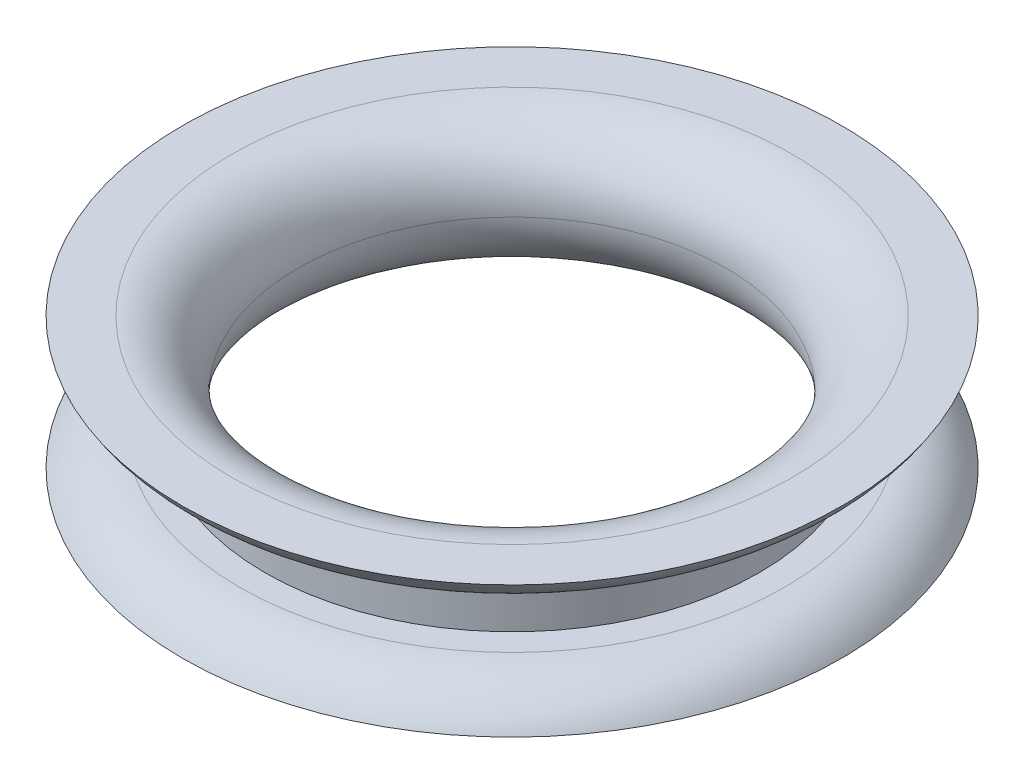
ISO-10303-21;
HEADER;
FILE_DESCRIPTION(('STEP AP214'),'2;1');
FILE_NAME('part.step','',(''),(''),'','','');
FILE_SCHEMA(('AUTOMOTIVE_DESIGN { 1 0 10303 214 1 1 1 1 }'));
ENDSEC;
DATA;
#1=APPLICATION_CONTEXT('core data for automotive mechanical design processes');
#2=APPLICATION_PROTOCOL_DEFINITION('international standard','automotive_design',2000,#1);
#3=PRODUCT_CONTEXT('',#1,'mechanical');
#4=PRODUCT('Part','Part','',(#3));
#5=PRODUCT_RELATED_PRODUCT_CATEGORY('part','',(#4));
#6=PRODUCT_DEFINITION_FORMATION('','',#4);
#7=PRODUCT_DEFINITION_CONTEXT('part definition',#1,'design');
#8=PRODUCT_DEFINITION('design','',#6,#7);
#9=PRODUCT_DEFINITION_SHAPE('','',#8);
#10=(LENGTH_UNIT() NAMED_UNIT(*) SI_UNIT(.MILLI.,.METRE.));
#11=(NAMED_UNIT(*) PLANE_ANGLE_UNIT() SI_UNIT($,.RADIAN.));
#12=(NAMED_UNIT(*) SI_UNIT($,.STERADIAN.) SOLID_ANGLE_UNIT());
#13=UNCERTAINTY_MEASURE_WITH_UNIT(LENGTH_MEASURE(1.E-05),#10,'distance_accuracy_value','');
#14=(GEOMETRIC_REPRESENTATION_CONTEXT(3) GLOBAL_UNCERTAINTY_ASSIGNED_CONTEXT((#13)) GLOBAL_UNIT_ASSIGNED_CONTEXT((#10,
#11,#12)) REPRESENTATION_CONTEXT('',''));
#15=CARTESIAN_POINT('',(0.,0.,0.));
#16=DIRECTION('',(0.,0.,1.));
#17=DIRECTION('',(1.,0.,0.));
#18=AXIS2_PLACEMENT_3D('',#15,#16,#17);
#19=CARTESIAN_POINT('',(0.,1.27,0.));
#20=DIRECTION('',(0.,1.,0.));
#21=DIRECTION('',(0.,0.,1.));
#22=AXIS2_PLACEMENT_3D('',#19,#20,#21);
#23=PLANE('',#22);
#24=CARTESIAN_POINT('',(0.,1.27,0.));
#25=DIRECTION('',(0.,1.,0.));
#26=DIRECTION('',(0.,0.,1.));
#27=AXIS2_PLACEMENT_3D('',#24,#25,#26);
#28=CIRCLE('',#27,10.5002954743875);
#29=CARTESIAN_POINT('',(0.,1.27,10.5002954743875));
#30=VERTEX_POINT('',#29);
#31=EDGE_CURVE('E57',#30,#30,#28,.T.);
#32=ORIENTED_EDGE('',*,*,#31,.T.);
#33=EDGE_LOOP('',(#32));
#34=FACE_BOUND('',#33,.T.);
#35=CARTESIAN_POINT('',(0.,1.27,0.));
#36=DIRECTION('',(0.,1.,0.));
#37=DIRECTION('',(0.,0.,1.));
#38=AXIS2_PLACEMENT_3D('',#35,#36,#37);
#39=CIRCLE('',#38,9.525);
#40=CARTESIAN_POINT('',(0.,1.27,9.525));
#41=VERTEX_POINT('',#40);
#42=EDGE_CURVE('E61',#41,#41,#39,.T.);
#43=ORIENTED_EDGE('',*,*,#42,.F.);
#44=EDGE_LOOP('',(#43));
#45=FACE_BOUND('',#44,.T.);
#46=ADVANCED_FACE('F37',(#34,#45),#23,.T.);
#47=CARTESIAN_POINT('',(0.,0.,0.));
#48=DIRECTION('',(0.,1.,0.));
#49=DIRECTION('',(0.,0.,1.));
#50=AXIS2_PLACEMENT_3D('',#47,#48,#49);
#51=PLANE('',#50);
#52=CARTESIAN_POINT('',(0.,0.,0.));
#53=DIRECTION('',(0.,1.,0.));
#54=DIRECTION('',(0.,0.,1.));
#55=AXIS2_PLACEMENT_3D('',#52,#53,#54);
#56=CIRCLE('',#55,10.795);
#57=CARTESIAN_POINT('',(0.,0.,10.795));
#58=VERTEX_POINT('',#57);
#59=EDGE_CURVE('E46',#58,#58,#56,.T.);
#60=ORIENTED_EDGE('',*,*,#59,.T.);
#61=EDGE_LOOP('',(#60));
#62=FACE_BOUND('',#61,.T.);
#63=CARTESIAN_POINT('',(0.,0.,0.));
#64=DIRECTION('',(0.,1.,0.));
#65=DIRECTION('',(0.,0.,1.));
#66=AXIS2_PLACEMENT_3D('',#63,#64,#65);
#67=CIRCLE('',#66,12.7);
#68=CARTESIAN_POINT('',(0.,0.,12.7));
#69=VERTEX_POINT('',#68);
#70=EDGE_CURVE('E62',#69,#69,#67,.T.);
#71=ORIENTED_EDGE('',*,*,#70,.F.);
#72=EDGE_LOOP('',(#71));
#73=FACE_BOUND('',#72,.T.);
#74=ADVANCED_FACE('F96',(#62,#73),#51,.F.);
#75=CARTESIAN_POINT('',(0.,3.81,0.));
#76=DIRECTION('',(0.,-1.,0.));
#77=DIRECTION('',(0.,0.,-1.));
#78=AXIS2_PLACEMENT_3D('',#75,#76,#77);
#79=CYLINDRICAL_SURFACE('',#78,9.525);
#80=CARTESIAN_POINT('',(0.,3.81,0.));
#81=DIRECTION('',(0.,1.,0.));
#82=DIRECTION('',(0.,0.,1.));
#83=AXIS2_PLACEMENT_3D('',#80,#81,#82);
#84=CIRCLE('',#83,9.525);
#85=CARTESIAN_POINT('',(0.,3.81,9.525));
#86=VERTEX_POINT('',#85);
#87=EDGE_CURVE('E66',#86,#86,#84,.T.);
#88=ORIENTED_EDGE('',*,*,#87,.F.);
#89=EDGE_LOOP('',(#88));
#90=FACE_BOUND('',#89,.T.);
#91=ORIENTED_EDGE('',*,*,#42,.T.);
#92=EDGE_LOOP('',(#91));
#93=FACE_BOUND('',#92,.T.);
#94=ADVANCED_FACE('F102',(#90,#93),#79,.T.);
#95=CARTESIAN_POINT('',(0.,5.08,0.));
#96=DIRECTION('',(0.,1.,0.));
#97=DIRECTION('',(0.,0.,1.));
#98=AXIS2_PLACEMENT_3D('',#95,#96,#97);
#99=PLANE('',#98);
#100=CARTESIAN_POINT('',(0.,5.08,0.));
#101=DIRECTION('',(0.,1.,0.));
#102=DIRECTION('',(0.,0.,1.));
#103=AXIS2_PLACEMENT_3D('',#100,#101,#102);
#104=CIRCLE('',#103,10.795);
#105=CARTESIAN_POINT('',(0.,5.08,10.795));
#106=VERTEX_POINT('',#105);
#107=EDGE_CURVE('E10',#106,#106,#104,.F.);
#108=ORIENTED_EDGE('',*,*,#107,.T.);
#109=EDGE_LOOP('',(#108));
#110=FACE_BOUND('',#109,.T.);
#111=CARTESIAN_POINT('',(0.,5.08,0.));
#112=DIRECTION('',(0.,1.,0.));
#113=DIRECTION('',(0.,0.,1.));
#114=AXIS2_PLACEMENT_3D('',#111,#112,#113);
#115=CIRCLE('',#114,12.7);
#116=CARTESIAN_POINT('',(0.,5.08,12.7));
#117=VERTEX_POINT('',#116);
#118=EDGE_CURVE('E73',#117,#117,#115,.T.);
#119=ORIENTED_EDGE('',*,*,#118,.T.);
#120=EDGE_LOOP('',(#119));
#121=FACE_BOUND('',#120,.T.);
#122=ADVANCED_FACE('F115',(#110,#121),#99,.T.);
#123=CARTESIAN_POINT('',(0.,3.81,0.));
#124=DIRECTION('',(0.,1.,0.));
#125=DIRECTION('',(0.,0.,1.));
#126=AXIS2_PLACEMENT_3D('',#123,#124,#125);
#127=PLANE('',#126);
#128=CARTESIAN_POINT('',(0.,3.81,0.));
#129=DIRECTION('',(0.,1.,0.));
#130=DIRECTION('',(0.,0.,1.));
#131=AXIS2_PLACEMENT_3D('',#128,#129,#130);
#132=CIRCLE('',#131,10.5002954743875);
#133=CARTESIAN_POINT('',(0.,3.81,10.5002954743875));
#134=VERTEX_POINT('',#133);
#135=EDGE_CURVE('E51',#134,#134,#132,.F.);
#136=ORIENTED_EDGE('',*,*,#135,.T.);
#137=EDGE_LOOP('',(#136));
#138=FACE_BOUND('',#137,.T.);
#139=ORIENTED_EDGE('',*,*,#87,.T.);
#140=EDGE_LOOP('',(#139));
#141=FACE_BOUND('',#140,.T.);
#142=ADVANCED_FACE('F110',(#138,#141),#127,.F.);
#143=CARTESIAN_POINT('',(0.,-1.27,0.));
#144=DIRECTION('',(0.,-1.,0.));
#145=DIRECTION('',(0.,0.,-1.));
#146=AXIS2_PLACEMENT_3D('',#143,#144,#145);
#147=TOROIDAL_SURFACE('',#146,10.5002954743875,2.54);
#148=ORIENTED_EDGE('',*,*,#70,.T.);
#149=EDGE_LOOP('',(#148));
#150=FACE_BOUND('',#149,.T.);
#151=ORIENTED_EDGE('',*,*,#31,.F.);
#152=EDGE_LOOP('',(#151));
#153=FACE_BOUND('',#152,.T.);
#154=ADVANCED_FACE('F92',(#150,#153),#147,.T.);
#155=CARTESIAN_POINT('',(0.,6.35,0.));
#156=DIRECTION('',(0.,-1.,0.));
#157=DIRECTION('',(0.,0.,-1.));
#158=AXIS2_PLACEMENT_3D('',#155,#156,#157);
#159=TOROIDAL_SURFACE('',#158,10.5002954743875,2.54);
#160=ORIENTED_EDGE('',*,*,#135,.F.);
#161=EDGE_LOOP('',(#160));
#162=FACE_BOUND('',#161,.T.);
#163=ORIENTED_EDGE('',*,*,#118,.F.);
#164=EDGE_LOOP('',(#163));
#165=FACE_BOUND('',#164,.T.);
#166=ADVANCED_FACE('F86',(#162,#165),#159,.T.);
#167=CARTESIAN_POINT('',(0.,2.54,0.));
#168=DIRECTION('',(0.,1.,0.));
#169=DIRECTION('',(0.,0.,1.));
#170=AXIS2_PLACEMENT_3D('',#167,#168,#169);
#171=TOROIDAL_SURFACE('',#170,10.795,2.54);
#172=ORIENTED_EDGE('',*,*,#107,.F.);
#173=EDGE_LOOP('',(#172));
#174=FACE_BOUND('',#173,.T.);
#175=CARTESIAN_POINT('',(0.,2.54,0.));
#176=DIRECTION('',(0.,1.,0.));
#177=DIRECTION('',(0.,0.,1.));
#178=AXIS2_PLACEMENT_3D('',#175,#176,#177);
#179=CIRCLE('',#178,8.255);
#180=CARTESIAN_POINT('',(0.,2.54,8.255));
#181=VERTEX_POINT('',#180);
#182=EDGE_CURVE('E41',#181,#181,#179,.T.);
#183=ORIENTED_EDGE('',*,*,#182,.F.);
#184=EDGE_LOOP('',(#183));
#185=FACE_BOUND('',#184,.T.);
#186=ADVANCED_FACE('F39',(#174,#185),#171,.T.);
#187=CARTESIAN_POINT('',(0.,2.54,0.));
#188=DIRECTION('',(0.,1.,0.));
#189=DIRECTION('',(0.,0.,1.));
#190=AXIS2_PLACEMENT_3D('',#187,#188,#189);
#191=TOROIDAL_SURFACE('',#190,10.795,2.54);
#192=ORIENTED_EDGE('',*,*,#182,.T.);
#193=EDGE_LOOP('',(#192));
#194=FACE_BOUND('',#193,.T.);
#195=ORIENTED_EDGE('',*,*,#59,.F.);
#196=EDGE_LOOP('',(#195));
#197=FACE_BOUND('',#196,.T.);
#198=ADVANCED_FACE('F82',(#194,#197),#191,.T.);
#199=CLOSED_SHELL('',(#46,#74,#94,#122,#142,#154,#166,#186,#198));
#200=MANIFOLD_SOLID_BREP('B2',#199);
#201=ADVANCED_BREP_SHAPE_REPRESENTATION('',(#18,#200),#14);
#202=SHAPE_DEFINITION_REPRESENTATION(#9,#201);
ENDSEC;
END-ISO-10303-21;
